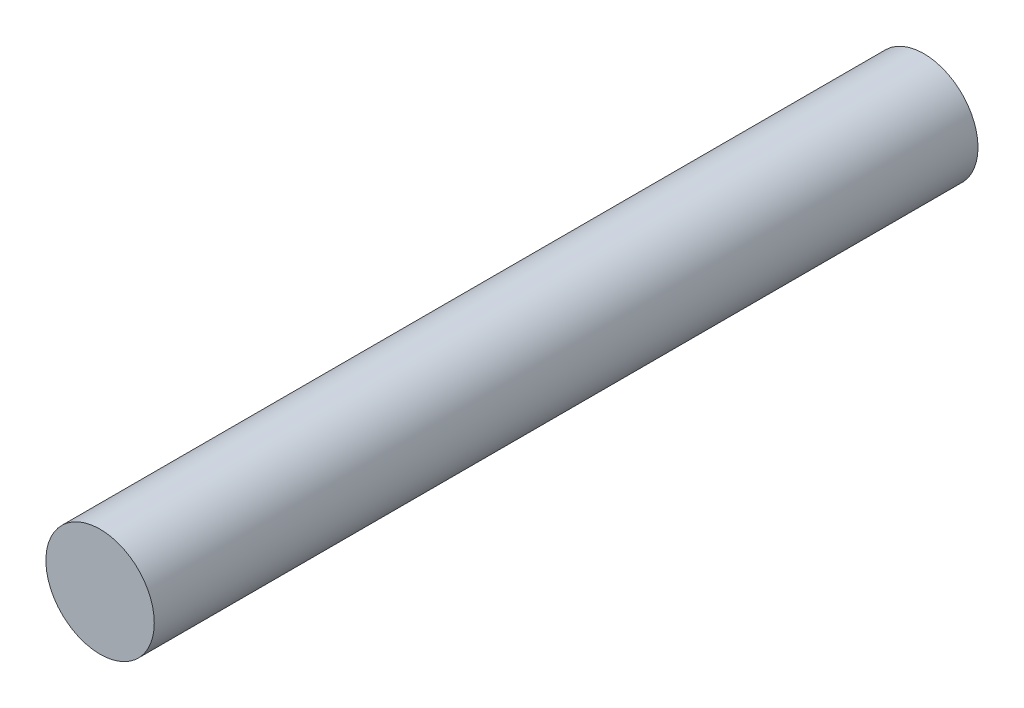
ISO-10303-21;
HEADER;
FILE_DESCRIPTION(('STEP AP214'),'2;1');
FILE_NAME('part.step','',(''),(''),'','','');
FILE_SCHEMA(('AUTOMOTIVE_DESIGN { 1 0 10303 214 1 1 1 1 }'));
ENDSEC;
DATA;
#1=APPLICATION_CONTEXT('core data for automotive mechanical design processes');
#2=APPLICATION_PROTOCOL_DEFINITION('international standard','automotive_design',2000,#1);
#3=PRODUCT_CONTEXT('',#1,'mechanical');
#4=PRODUCT('Part','Part','',(#3));
#5=PRODUCT_RELATED_PRODUCT_CATEGORY('part','',(#4));
#6=PRODUCT_DEFINITION_FORMATION('','',#4);
#7=PRODUCT_DEFINITION_CONTEXT('part definition',#1,'design');
#8=PRODUCT_DEFINITION('design','',#6,#7);
#9=PRODUCT_DEFINITION_SHAPE('','',#8);
#10=(LENGTH_UNIT() NAMED_UNIT(*) SI_UNIT(.MILLI.,.METRE.));
#11=(NAMED_UNIT(*) PLANE_ANGLE_UNIT() SI_UNIT($,.RADIAN.));
#12=(NAMED_UNIT(*) SI_UNIT($,.STERADIAN.) SOLID_ANGLE_UNIT());
#13=UNCERTAINTY_MEASURE_WITH_UNIT(LENGTH_MEASURE(1.E-05),#10,'distance_accuracy_value','');
#14=(GEOMETRIC_REPRESENTATION_CONTEXT(3) GLOBAL_UNCERTAINTY_ASSIGNED_CONTEXT((#13)) GLOBAL_UNIT_ASSIGNED_CONTEXT((#10,
#11,#12)) REPRESENTATION_CONTEXT('',''));
#15=CARTESIAN_POINT('',(0.,0.,0.));
#16=DIRECTION('',(0.,0.,1.));
#17=DIRECTION('',(1.,0.,0.));
#18=AXIS2_PLACEMENT_3D('',#15,#16,#17);
#19=CARTESIAN_POINT('',(286.452894146382,-18.0333838044002,-229.327717103892));
#20=DIRECTION('',(0.,0.,-1.));
#21=DIRECTION('',(-1.,0.,0.));
#22=AXIS2_PLACEMENT_3D('',#19,#20,#21);
#23=CYLINDRICAL_SURFACE('',#22,6.35);
#24=CARTESIAN_POINT('',(286.452894146382,-18.0333838044002,-343.80822934603));
#25=DIRECTION('',(0.,0.,1.));
#26=DIRECTION('',(1.,0.,0.));
#27=AXIS2_PLACEMENT_3D('',#24,#25,#26);
#28=CIRCLE('',#27,6.35);
#29=CARTESIAN_POINT('',(292.802894146382,-18.0333838044002,-343.80822934603));
#30=VERTEX_POINT('',#29);
#31=EDGE_CURVE('E53',#30,#30,#28,.T.);
#32=ORIENTED_EDGE('',*,*,#31,.T.);
#33=EDGE_LOOP('',(#32));
#34=FACE_BOUND('',#33,.T.);
#35=CARTESIAN_POINT('',(286.452894146382,-18.0333838044002,-247.28822934603));
#36=DIRECTION('',(0.,0.,1.));
#37=DIRECTION('',(1.,0.,0.));
#38=AXIS2_PLACEMENT_3D('',#35,#36,#37);
#39=CIRCLE('',#38,6.35);
#40=CARTESIAN_POINT('',(292.802894146382,-18.0333838044002,-247.28822934603));
#41=VERTEX_POINT('',#40);
#42=EDGE_CURVE('E11',#41,#41,#39,.T.);
#43=ORIENTED_EDGE('',*,*,#42,.F.);
#44=EDGE_LOOP('',(#43));
#45=FACE_BOUND('',#44,.T.);
#46=ADVANCED_FACE('F46',(#34,#45),#23,.T.);
#47=CARTESIAN_POINT('',(286.452894146382,-18.0333838044002,-343.80822934603));
#48=DIRECTION('',(0.,0.,1.));
#49=DIRECTION('',(1.,0.,0.));
#50=AXIS2_PLACEMENT_3D('',#47,#48,#49);
#51=PLANE('',#50);
#52=ORIENTED_EDGE('',*,*,#31,.F.);
#53=EDGE_LOOP('',(#52));
#54=FACE_BOUND('',#53,.T.);
#55=ADVANCED_FACE('F61',(#54),#51,.F.);
#56=CARTESIAN_POINT('',(0.,0.,-247.28822934603));
#57=DIRECTION('',(0.,0.,1.));
#58=DIRECTION('',(1.,0.,0.));
#59=AXIS2_PLACEMENT_3D('',#56,#57,#58);
#60=PLANE('',#59);
#61=ORIENTED_EDGE('',*,*,#42,.T.);
#62=EDGE_LOOP('',(#61));
#63=FACE_BOUND('',#62,.T.);
#64=ADVANCED_FACE('F48',(#63),#60,.T.);
#65=CLOSED_SHELL('',(#46,#55,#64));
#66=MANIFOLD_SOLID_BREP('B2',#65);
#67=ADVANCED_BREP_SHAPE_REPRESENTATION('',(#18,#66),#14);
#68=SHAPE_DEFINITION_REPRESENTATION(#9,#67);
ENDSEC;
END-ISO-10303-21;
